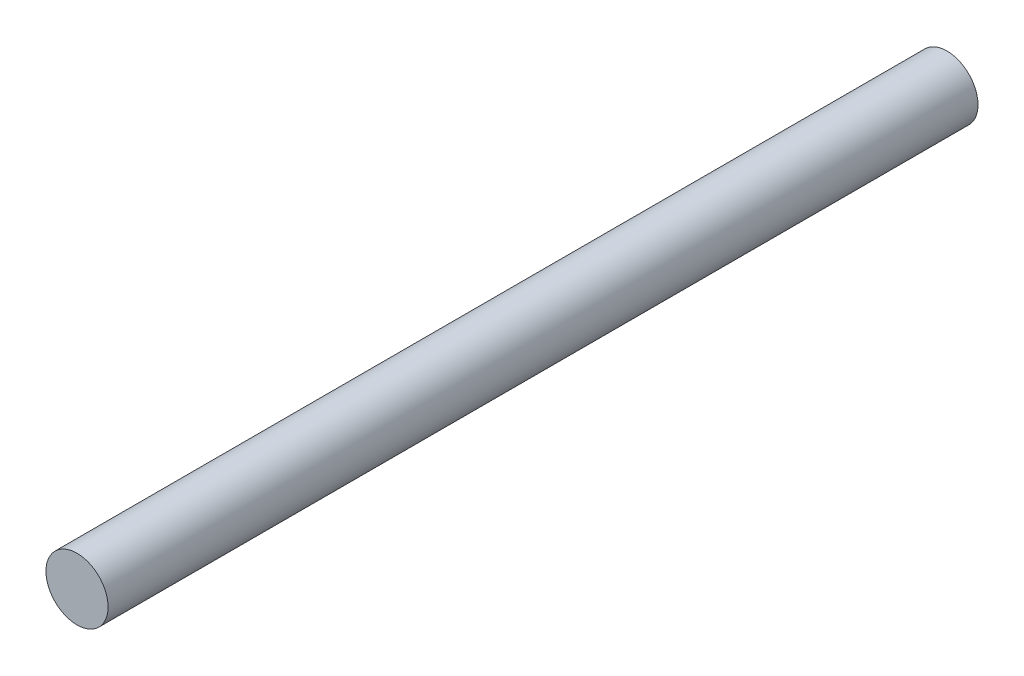
ISO-10303-21;
HEADER;
FILE_DESCRIPTION(('STEP AP214'),'2;1');
FILE_NAME('part.step','',(''),(''),'','','');
FILE_SCHEMA(('AUTOMOTIVE_DESIGN { 1 0 10303 214 1 1 1 1 }'));
ENDSEC;
DATA;
#1=APPLICATION_CONTEXT('core data for automotive mechanical design processes');
#2=APPLICATION_PROTOCOL_DEFINITION('international standard','automotive_design',2000,#1);
#3=PRODUCT_CONTEXT('',#1,'mechanical');
#4=PRODUCT('Part','Part','',(#3));
#5=PRODUCT_RELATED_PRODUCT_CATEGORY('part','',(#4));
#6=PRODUCT_DEFINITION_FORMATION('','',#4);
#7=PRODUCT_DEFINITION_CONTEXT('part definition',#1,'design');
#8=PRODUCT_DEFINITION('design','',#6,#7);
#9=PRODUCT_DEFINITION_SHAPE('','',#8);
#10=(LENGTH_UNIT() NAMED_UNIT(*) SI_UNIT(.MILLI.,.METRE.));
#11=(NAMED_UNIT(*) PLANE_ANGLE_UNIT() SI_UNIT($,.RADIAN.));
#12=(NAMED_UNIT(*) SI_UNIT($,.STERADIAN.) SOLID_ANGLE_UNIT());
#13=UNCERTAINTY_MEASURE_WITH_UNIT(LENGTH_MEASURE(1.E-05),#10,'distance_accuracy_value','');
#14=(GEOMETRIC_REPRESENTATION_CONTEXT(3) GLOBAL_UNCERTAINTY_ASSIGNED_CONTEXT((#13)) GLOBAL_UNIT_ASSIGNED_CONTEXT((#10,
#11,#12)) REPRESENTATION_CONTEXT('',''));
#15=CARTESIAN_POINT('',(0.,0.,0.));
#16=DIRECTION('',(0.,0.,1.));
#17=DIRECTION('',(1.,0.,0.));
#18=AXIS2_PLACEMENT_3D('',#15,#16,#17);
#19=CARTESIAN_POINT('',(0.,0.,84.));
#20=DIRECTION('',(0.,0.,-1.));
#21=DIRECTION('',(-1.,0.,0.));
#22=AXIS2_PLACEMENT_3D('',#19,#20,#21);
#23=CYLINDRICAL_SURFACE('',#22,3.);
#24=CARTESIAN_POINT('',(0.,0.,84.));
#25=DIRECTION('',(0.,0.,1.));
#26=DIRECTION('',(1.,0.,0.));
#27=AXIS2_PLACEMENT_3D('',#24,#25,#26);
#28=CIRCLE('',#27,3.);
#29=CARTESIAN_POINT('',(3.,0.,84.));
#30=VERTEX_POINT('',#29);
#31=EDGE_CURVE('E10',#30,#30,#28,.T.);
#32=ORIENTED_EDGE('',*,*,#31,.F.);
#33=EDGE_LOOP('',(#32));
#34=FACE_BOUND('',#33,.T.);
#35=CARTESIAN_POINT('',(0.,0.,0.));
#36=DIRECTION('',(0.,0.,1.));
#37=DIRECTION('',(1.,0.,0.));
#38=AXIS2_PLACEMENT_3D('',#35,#36,#37);
#39=CIRCLE('',#38,3.);
#40=CARTESIAN_POINT('',(3.,0.,0.));
#41=VERTEX_POINT('',#40);
#42=EDGE_CURVE('E38',#41,#41,#39,.T.);
#43=ORIENTED_EDGE('',*,*,#42,.T.);
#44=EDGE_LOOP('',(#43));
#45=FACE_BOUND('',#44,.T.);
#46=ADVANCED_FACE('F35',(#34,#45),#23,.T.);
#47=CARTESIAN_POINT('',(0.,0.,84.));
#48=DIRECTION('',(0.,0.,1.));
#49=DIRECTION('',(1.,0.,0.));
#50=AXIS2_PLACEMENT_3D('',#47,#48,#49);
#51=PLANE('',#50);
#52=ORIENTED_EDGE('',*,*,#31,.T.);
#53=EDGE_LOOP('',(#52));
#54=FACE_BOUND('',#53,.T.);
#55=ADVANCED_FACE('F50',(#54),#51,.T.);
#56=CARTESIAN_POINT('',(0.,0.,0.));
#57=DIRECTION('',(0.,0.,1.));
#58=DIRECTION('',(1.,0.,0.));
#59=AXIS2_PLACEMENT_3D('',#56,#57,#58);
#60=PLANE('',#59);
#61=ORIENTED_EDGE('',*,*,#42,.F.);
#62=EDGE_LOOP('',(#61));
#63=FACE_BOUND('',#62,.T.);
#64=ADVANCED_FACE('F48',(#63),#60,.F.);
#65=CLOSED_SHELL('',(#46,#55,#64));
#66=MANIFOLD_SOLID_BREP('B2',#65);
#67=ADVANCED_BREP_SHAPE_REPRESENTATION('',(#18,#66),#14);
#68=SHAPE_DEFINITION_REPRESENTATION(#9,#67);
ENDSEC;
END-ISO-10303-21;
